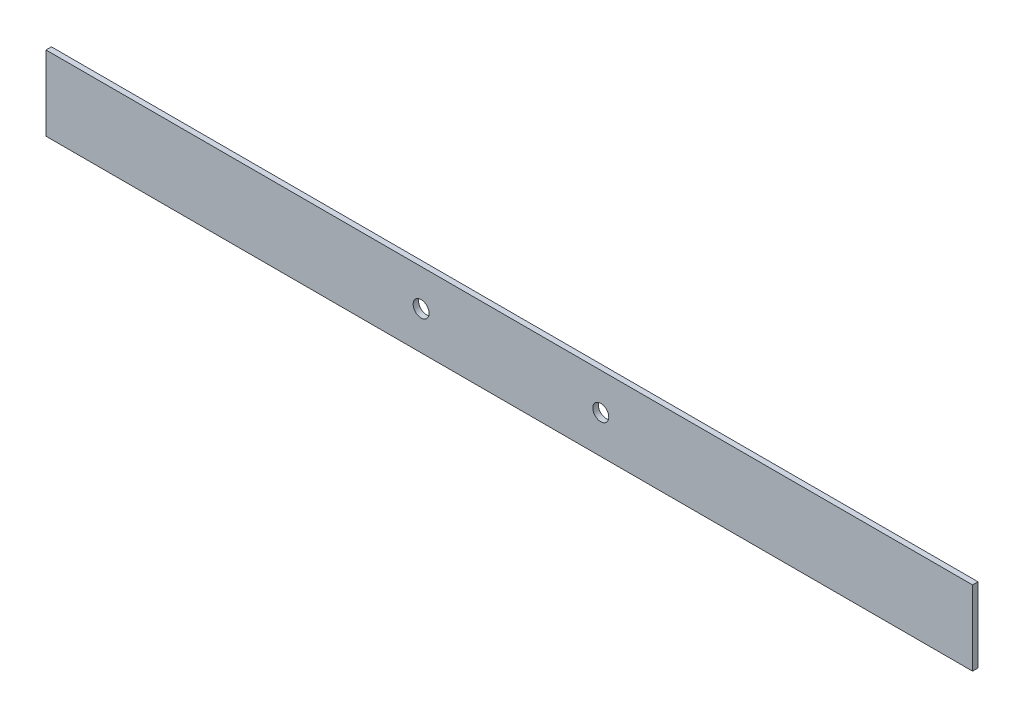
ISO-10303-21;
HEADER;
FILE_DESCRIPTION(('STEP AP214'),'2;1');
FILE_NAME('part.step','',(''),(''),'','','');
FILE_SCHEMA(('AUTOMOTIVE_DESIGN { 1 0 10303 214 1 1 1 1 }'));
ENDSEC;
DATA;
#1=APPLICATION_CONTEXT('core data for automotive mechanical design processes');
#2=APPLICATION_PROTOCOL_DEFINITION('international standard','automotive_design',2000,#1);
#3=PRODUCT_CONTEXT('',#1,'mechanical');
#4=PRODUCT('Part','Part','',(#3));
#5=PRODUCT_RELATED_PRODUCT_CATEGORY('part','',(#4));
#6=PRODUCT_DEFINITION_FORMATION('','',#4);
#7=PRODUCT_DEFINITION_CONTEXT('part definition',#1,'design');
#8=PRODUCT_DEFINITION('design','',#6,#7);
#9=PRODUCT_DEFINITION_SHAPE('','',#8);
#10=(LENGTH_UNIT() NAMED_UNIT(*) SI_UNIT(.MILLI.,.METRE.));
#11=(NAMED_UNIT(*) PLANE_ANGLE_UNIT() SI_UNIT($,.RADIAN.));
#12=(NAMED_UNIT(*) SI_UNIT($,.STERADIAN.) SOLID_ANGLE_UNIT());
#13=UNCERTAINTY_MEASURE_WITH_UNIT(LENGTH_MEASURE(1.E-05),#10,'distance_accuracy_value','');
#14=(GEOMETRIC_REPRESENTATION_CONTEXT(3) GLOBAL_UNCERTAINTY_ASSIGNED_CONTEXT((#13)) GLOBAL_UNIT_ASSIGNED_CONTEXT((#10,
#11,#12)) REPRESENTATION_CONTEXT('',''));
#15=CARTESIAN_POINT('',(0.,0.,0.));
#16=DIRECTION('',(0.,0.,1.));
#17=DIRECTION('',(1.,0.,0.));
#18=AXIS2_PLACEMENT_3D('',#15,#16,#17);
#19=CARTESIAN_POINT('',(124.,98.5,1.09144054));
#20=DIRECTION('',(0.,0.,-1.));
#21=DIRECTION('',(0.,-1.,0.));
#22=AXIS2_PLACEMENT_3D('',#19,#20,#21);
#23=PLANE('',#22);
#24=CARTESIAN_POINT('',(142.37,98.649,1.09144054));
#25=DIRECTION('',(0.,0.,1.));
#26=DIRECTION('',(1.,0.,0.));
#27=AXIS2_PLACEMENT_3D('',#24,#25,#26);
#28=CIRCLE('',#27,1.6);
#29=CARTESIAN_POINT('',(143.97,98.649,1.09144054));
#30=VERTEX_POINT('',#29);
#31=EDGE_CURVE('E26',#30,#30,#28,.T.);
#32=ORIENTED_EDGE('',*,*,#31,.F.);
#33=EDGE_LOOP('',(#32));
#34=FACE_BOUND('',#33,.T.);
#35=CARTESIAN_POINT('',(106.302,98.649,1.09144054));
#36=DIRECTION('',(0.,0.,1.));
#37=DIRECTION('',(1.,0.,0.));
#38=AXIS2_PLACEMENT_3D('',#35,#36,#37);
#39=CIRCLE('',#38,1.6);
#40=CARTESIAN_POINT('',(107.902,98.649,1.09144054));
#41=VERTEX_POINT('',#40);
#42=EDGE_CURVE('E82',#41,#41,#39,.T.);
#43=ORIENTED_EDGE('',*,*,#42,.F.);
#44=EDGE_LOOP('',(#43));
#45=FACE_BOUND('',#44,.T.);
#46=DIRECTION('',(-1.,0.,0.));
#47=VECTOR('',#46,1.);
#48=CARTESIAN_POINT('',(217.,91.,1.09144054));
#49=LINE('',#48,#47);
#50=CARTESIAN_POINT('',(217.,91.,1.09144054));
#51=VERTEX_POINT('',#50);
#52=CARTESIAN_POINT('',(31.,91.,1.09144054));
#53=VERTEX_POINT('',#52);
#54=EDGE_CURVE('E129',#51,#53,#49,.T.);
#55=ORIENTED_EDGE('',*,*,#54,.F.);
#56=DIRECTION('',(0.,-1.,0.));
#57=VECTOR('',#56,1.);
#58=CARTESIAN_POINT('',(217.,106.,1.09144054));
#59=LINE('',#58,#57);
#60=CARTESIAN_POINT('',(217.,106.,1.09144054));
#61=VERTEX_POINT('',#60);
#62=EDGE_CURVE('E134',#61,#51,#59,.T.);
#63=ORIENTED_EDGE('',*,*,#62,.F.);
#64=DIRECTION('',(1.,0.,0.));
#65=VECTOR('',#64,1.);
#66=CARTESIAN_POINT('',(31.,106.,1.09144054));
#67=LINE('',#66,#65);
#68=CARTESIAN_POINT('',(31.,106.,1.09144054));
#69=VERTEX_POINT('',#68);
#70=EDGE_CURVE('E150',#69,#61,#67,.T.);
#71=ORIENTED_EDGE('',*,*,#70,.F.);
#72=DIRECTION('',(0.,1.,0.));
#73=VECTOR('',#72,1.);
#74=CARTESIAN_POINT('',(31.,91.,1.09144054));
#75=LINE('',#74,#73);
#76=EDGE_CURVE('E178',#53,#69,#75,.T.);
#77=ORIENTED_EDGE('',*,*,#76,.F.);
#78=EDGE_LOOP('',(#55,#63,#71,#77));
#79=FACE_BOUND('',#78,.T.);
#80=ADVANCED_FACE('F17',(#34,#45,#79),#23,.F.);
#81=CARTESIAN_POINT('',(124.,98.5,0.));
#82=DIRECTION('',(0.,0.,-1.));
#83=DIRECTION('',(0.,-1.,0.));
#84=AXIS2_PLACEMENT_3D('',#81,#82,#83);
#85=PLANE('',#84);
#86=CARTESIAN_POINT('',(142.37,98.649,0.));
#87=DIRECTION('',(0.,0.,1.));
#88=DIRECTION('',(1.,0.,0.));
#89=AXIS2_PLACEMENT_3D('',#86,#87,#88);
#90=CIRCLE('',#89,1.6);
#91=CARTESIAN_POINT('',(143.97,98.649,0.));
#92=VERTEX_POINT('',#91);
#93=EDGE_CURVE('E11',#92,#92,#90,.T.);
#94=ORIENTED_EDGE('',*,*,#93,.T.);
#95=EDGE_LOOP('',(#94));
#96=FACE_BOUND('',#95,.T.);
#97=CARTESIAN_POINT('',(106.302,98.649,0.));
#98=DIRECTION('',(0.,0.,1.));
#99=DIRECTION('',(1.,0.,0.));
#100=AXIS2_PLACEMENT_3D('',#97,#98,#99);
#101=CIRCLE('',#100,1.6);
#102=CARTESIAN_POINT('',(107.902,98.649,0.));
#103=VERTEX_POINT('',#102);
#104=EDGE_CURVE('E88',#103,#103,#101,.T.);
#105=ORIENTED_EDGE('',*,*,#104,.T.);
#106=EDGE_LOOP('',(#105));
#107=FACE_BOUND('',#106,.T.);
#108=DIRECTION('',(0.,1.,0.));
#109=VECTOR('',#108,1.);
#110=CARTESIAN_POINT('',(31.,91.,0.));
#111=LINE('',#110,#109);
#112=CARTESIAN_POINT('',(31.,91.,0.));
#113=VERTEX_POINT('',#112);
#114=CARTESIAN_POINT('',(31.,106.,0.));
#115=VERTEX_POINT('',#114);
#116=EDGE_CURVE('E155',#113,#115,#111,.T.);
#117=ORIENTED_EDGE('',*,*,#116,.T.);
#118=DIRECTION('',(1.,0.,0.));
#119=VECTOR('',#118,1.);
#120=CARTESIAN_POINT('',(31.,106.,0.));
#121=LINE('',#120,#119);
#122=CARTESIAN_POINT('',(217.,106.,0.));
#123=VERTEX_POINT('',#122);
#124=EDGE_CURVE('E139',#115,#123,#121,.T.);
#125=ORIENTED_EDGE('',*,*,#124,.T.);
#126=DIRECTION('',(0.,-1.,0.));
#127=VECTOR('',#126,1.);
#128=CARTESIAN_POINT('',(217.,106.,0.));
#129=LINE('',#128,#127);
#130=CARTESIAN_POINT('',(217.,91.,0.));
#131=VERTEX_POINT('',#130);
#132=EDGE_CURVE('E124',#123,#131,#129,.T.);
#133=ORIENTED_EDGE('',*,*,#132,.T.);
#134=DIRECTION('',(-1.,0.,0.));
#135=VECTOR('',#134,1.);
#136=CARTESIAN_POINT('',(217.,91.,0.));
#137=LINE('',#136,#135);
#138=EDGE_CURVE('E97',#131,#113,#137,.T.);
#139=ORIENTED_EDGE('',*,*,#138,.T.);
#140=EDGE_LOOP('',(#117,#125,#133,#139));
#141=FACE_BOUND('',#140,.T.);
#142=ADVANCED_FACE('F216',(#96,#107,#141),#85,.T.);
#143=CARTESIAN_POINT('',(142.37,98.649,0.));
#144=DIRECTION('',(0.,0.,-1.));
#145=DIRECTION('',(1.,0.,0.));
#146=AXIS2_PLACEMENT_3D('',#143,#144,#145);
#147=CYLINDRICAL_SURFACE('',#146,1.6);
#148=DIRECTION('',(0.,0.,1.));
#149=VECTOR('',#148,1.);
#150=CARTESIAN_POINT('',(143.97,98.649,0.));
#151=LINE('',#150,#149);
#152=EDGE_CURVE('E95',#92,#30,#151,.T.);
#153=ORIENTED_EDGE('',*,*,#152,.T.);
#154=ORIENTED_EDGE('',*,*,#31,.T.);
#155=ORIENTED_EDGE('',*,*,#152,.F.);
#156=ORIENTED_EDGE('',*,*,#93,.F.);
#157=EDGE_LOOP('',(#153,#154,#155,#156));
#158=FACE_BOUND('',#157,.T.);
#159=ADVANCED_FACE('F234',(#158),#147,.F.);
#160=CARTESIAN_POINT('',(106.302,98.649,0.));
#161=DIRECTION('',(0.,0.,-1.));
#162=DIRECTION('',(1.,0.,0.));
#163=AXIS2_PLACEMENT_3D('',#160,#161,#162);
#164=CYLINDRICAL_SURFACE('',#163,1.6);
#165=DIRECTION('',(0.,0.,1.));
#166=VECTOR('',#165,1.);
#167=CARTESIAN_POINT('',(107.902,98.649,0.));
#168=LINE('',#167,#166);
#169=EDGE_CURVE('E85',#103,#41,#168,.T.);
#170=ORIENTED_EDGE('',*,*,#169,.T.);
#171=ORIENTED_EDGE('',*,*,#42,.T.);
#172=ORIENTED_EDGE('',*,*,#169,.F.);
#173=ORIENTED_EDGE('',*,*,#104,.F.);
#174=EDGE_LOOP('',(#170,#171,#172,#173));
#175=FACE_BOUND('',#174,.T.);
#176=ADVANCED_FACE('F83',(#175),#164,.F.);
#177=CARTESIAN_POINT('',(217.,91.,0.));
#178=DIRECTION('',(0.,-1.,0.));
#179=DIRECTION('',(0.,0.,-1.));
#180=AXIS2_PLACEMENT_3D('',#177,#178,#179);
#181=PLANE('',#180);
#182=DIRECTION('',(0.,0.,1.));
#183=VECTOR('',#182,1.);
#184=CARTESIAN_POINT('',(217.,91.,0.));
#185=LINE('',#184,#183);
#186=EDGE_CURVE('E130',#131,#51,#185,.T.);
#187=ORIENTED_EDGE('',*,*,#186,.T.);
#188=ORIENTED_EDGE('',*,*,#54,.T.);
#189=DIRECTION('',(0.,0.,1.));
#190=VECTOR('',#189,1.);
#191=CARTESIAN_POINT('',(31.,91.,0.));
#192=LINE('',#191,#190);
#193=EDGE_CURVE('E189',#113,#53,#192,.T.);
#194=ORIENTED_EDGE('',*,*,#193,.F.);
#195=ORIENTED_EDGE('',*,*,#138,.F.);
#196=EDGE_LOOP('',(#187,#188,#194,#195));
#197=FACE_BOUND('',#196,.T.);
#198=ADVANCED_FACE('F209',(#197),#181,.T.);
#199=CARTESIAN_POINT('',(217.,106.,0.));
#200=DIRECTION('',(1.,0.,0.));
#201=DIRECTION('',(0.,1.,0.));
#202=AXIS2_PLACEMENT_3D('',#199,#200,#201);
#203=PLANE('',#202);
#204=DIRECTION('',(0.,0.,1.));
#205=VECTOR('',#204,1.);
#206=CARTESIAN_POINT('',(217.,106.,0.));
#207=LINE('',#206,#205);
#208=EDGE_CURVE('E146',#123,#61,#207,.T.);
#209=ORIENTED_EDGE('',*,*,#208,.T.);
#210=ORIENTED_EDGE('',*,*,#62,.T.);
#211=ORIENTED_EDGE('',*,*,#186,.F.);
#212=ORIENTED_EDGE('',*,*,#132,.F.);
#213=EDGE_LOOP('',(#209,#210,#211,#212));
#214=FACE_BOUND('',#213,.T.);
#215=ADVANCED_FACE('F218',(#214),#203,.T.);
#216=CARTESIAN_POINT('',(31.,106.,0.));
#217=DIRECTION('',(0.,1.,0.));
#218=DIRECTION('',(1.,0.,0.));
#219=AXIS2_PLACEMENT_3D('',#216,#217,#218);
#220=PLANE('',#219);
#221=DIRECTION('',(0.,0.,1.));
#222=VECTOR('',#221,1.);
#223=CARTESIAN_POINT('',(31.,106.,0.));
#224=LINE('',#223,#222);
#225=EDGE_CURVE('E166',#115,#69,#224,.T.);
#226=ORIENTED_EDGE('',*,*,#225,.T.);
#227=ORIENTED_EDGE('',*,*,#70,.T.);
#228=ORIENTED_EDGE('',*,*,#208,.F.);
#229=ORIENTED_EDGE('',*,*,#124,.F.);
#230=EDGE_LOOP('',(#226,#227,#228,#229));
#231=FACE_BOUND('',#230,.T.);
#232=ADVANCED_FACE('F214',(#231),#220,.T.);
#233=CARTESIAN_POINT('',(31.,91.,0.));
#234=DIRECTION('',(-1.,0.,0.));
#235=DIRECTION('',(0.,0.,1.));
#236=AXIS2_PLACEMENT_3D('',#233,#234,#235);
#237=PLANE('',#236);
#238=ORIENTED_EDGE('',*,*,#193,.T.);
#239=ORIENTED_EDGE('',*,*,#76,.T.);
#240=ORIENTED_EDGE('',*,*,#225,.F.);
#241=ORIENTED_EDGE('',*,*,#116,.F.);
#242=EDGE_LOOP('',(#238,#239,#240,#241));
#243=FACE_BOUND('',#242,.T.);
#244=ADVANCED_FACE('F205',(#243),#237,.T.);
#245=CLOSED_SHELL('',(#80,#142,#159,#176,#198,#215,#232,#244));
#246=MANIFOLD_SOLID_BREP('B1',#245);
#247=ADVANCED_BREP_SHAPE_REPRESENTATION('',(#18,#246),#14);
#248=SHAPE_DEFINITION_REPRESENTATION(#9,#247);
ENDSEC;
END-ISO-10303-21;
